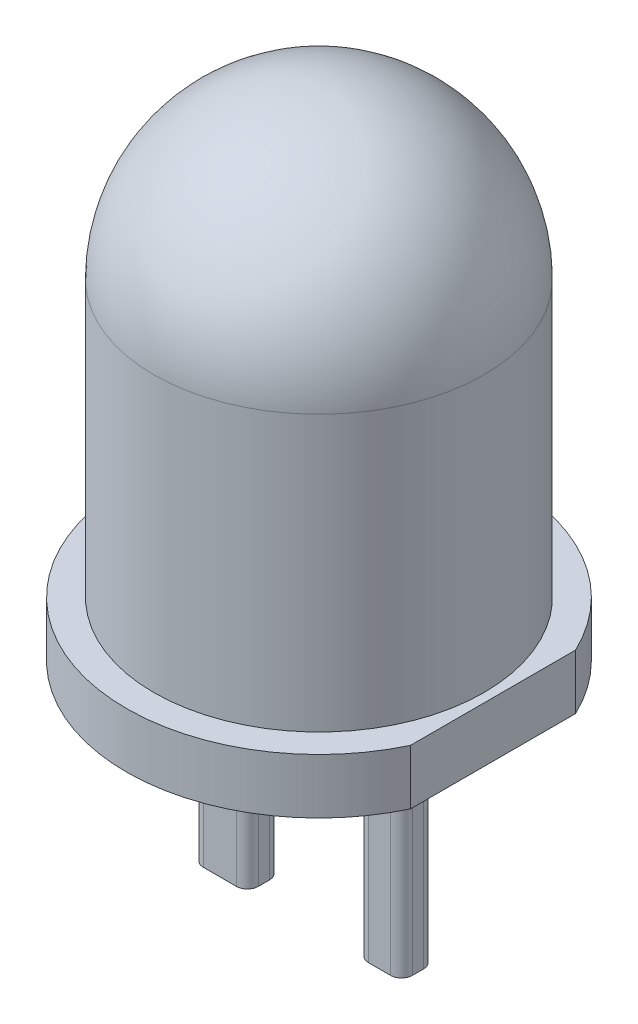
ISO-10303-21;
HEADER;
FILE_DESCRIPTION(('STEP AP214'),'2;1');
FILE_NAME('part.step','',(''),(''),'','','');
FILE_SCHEMA(('AUTOMOTIVE_DESIGN { 1 0 10303 214 1 1 1 1 }'));
ENDSEC;
DATA;
#1=APPLICATION_CONTEXT('core data for automotive mechanical design processes');
#2=APPLICATION_PROTOCOL_DEFINITION('international standard','automotive_design',2000,#1);
#3=PRODUCT_CONTEXT('',#1,'mechanical');
#4=PRODUCT('Part','Part','',(#3));
#5=PRODUCT_RELATED_PRODUCT_CATEGORY('part','',(#4));
#6=PRODUCT_DEFINITION_FORMATION('','',#4);
#7=PRODUCT_DEFINITION_CONTEXT('part definition',#1,'design');
#8=PRODUCT_DEFINITION('design','',#6,#7);
#9=PRODUCT_DEFINITION_SHAPE('','',#8);
#10=(LENGTH_UNIT() NAMED_UNIT(*) SI_UNIT(.MILLI.,.METRE.));
#11=(NAMED_UNIT(*) PLANE_ANGLE_UNIT() SI_UNIT($,.RADIAN.));
#12=(NAMED_UNIT(*) SI_UNIT($,.STERADIAN.) SOLID_ANGLE_UNIT());
#13=UNCERTAINTY_MEASURE_WITH_UNIT(LENGTH_MEASURE(1.E-05),#10,'distance_accuracy_value','');
#14=(GEOMETRIC_REPRESENTATION_CONTEXT(3) GLOBAL_UNCERTAINTY_ASSIGNED_CONTEXT((#13)) GLOBAL_UNIT_ASSIGNED_CONTEXT((#10,
#11,#12)) REPRESENTATION_CONTEXT('',''));
#15=CARTESIAN_POINT('',(0.,0.,0.));
#16=DIRECTION('',(0.,0.,1.));
#17=DIRECTION('',(1.,0.,0.));
#18=AXIS2_PLACEMENT_3D('',#15,#16,#17);
#19=CARTESIAN_POINT('',(0.,0.,0.));
#20=DIRECTION('',(0.,1.,0.));
#21=DIRECTION('',(0.,0.,1.));
#22=AXIS2_PLACEMENT_3D('',#19,#20,#21);
#23=PLANE('',#22);
#24=CARTESIAN_POINT('',(0.8,0.,0.05));
#25=DIRECTION('',(0.,-1.,0.));
#26=DIRECTION('',(0.,0.,1.));
#27=AXIS2_PLACEMENT_3D('',#24,#25,#26);
#28=CIRCLE('',#27,0.1);
#29=CARTESIAN_POINT('',(0.9,0.,0.0499999999999993));
#30=VERTEX_POINT('',#29);
#31=CARTESIAN_POINT('',(0.799999999999999,0.,0.15));
#32=VERTEX_POINT('',#31);
#33=EDGE_CURVE('E180',#30,#32,#28,.T.);
#34=ORIENTED_EDGE('',*,*,#33,.F.);
#35=DIRECTION('',(0.,0.,1.));
#36=VECTOR('',#35,1.);
#37=CARTESIAN_POINT('',(0.9,0.,0.0499999999999993));
#38=LINE('',#37,#36);
#39=CARTESIAN_POINT('',(0.9,0.,-0.0499999999999993));
#40=VERTEX_POINT('',#39);
#41=EDGE_CURVE('E193',#40,#30,#38,.T.);
#42=ORIENTED_EDGE('',*,*,#41,.F.);
#43=CARTESIAN_POINT('',(0.8,0.,-0.05));
#44=DIRECTION('',(0.,-1.,0.));
#45=DIRECTION('',(0.,0.,-1.));
#46=AXIS2_PLACEMENT_3D('',#43,#44,#45);
#47=CIRCLE('',#46,0.1);
#48=CARTESIAN_POINT('',(0.799999999999999,0.,-0.15));
#49=VERTEX_POINT('',#48);
#50=EDGE_CURVE('E222',#49,#40,#47,.T.);
#51=ORIENTED_EDGE('',*,*,#50,.F.);
#52=DIRECTION('',(1.,0.,0.));
#53=VECTOR('',#52,1.);
#54=CARTESIAN_POINT('',(0.600000000000001,0.,-0.15));
#55=LINE('',#54,#53);
#56=CARTESIAN_POINT('',(0.600000000000001,0.,-0.15));
#57=VERTEX_POINT('',#56);
#58=EDGE_CURVE('E219',#57,#49,#55,.T.);
#59=ORIENTED_EDGE('',*,*,#58,.F.);
#60=CARTESIAN_POINT('',(0.6,0.,-0.05));
#61=DIRECTION('',(0.,-1.,0.));
#62=DIRECTION('',(0.,0.,-1.));
#63=AXIS2_PLACEMENT_3D('',#60,#61,#62);
#64=CIRCLE('',#63,0.1);
#65=CARTESIAN_POINT('',(0.5,0.,-0.0499999999999993));
#66=VERTEX_POINT('',#65);
#67=EDGE_CURVE('E216',#66,#57,#64,.T.);
#68=ORIENTED_EDGE('',*,*,#67,.F.);
#69=DIRECTION('',(0.,0.,-1.));
#70=VECTOR('',#69,1.);
#71=CARTESIAN_POINT('',(0.5,0.,0.0499999999999993));
#72=LINE('',#71,#70);
#73=CARTESIAN_POINT('',(0.5,0.,0.0499999999999993));
#74=VERTEX_POINT('',#73);
#75=EDGE_CURVE('E213',#74,#66,#72,.T.);
#76=ORIENTED_EDGE('',*,*,#75,.F.);
#77=CARTESIAN_POINT('',(0.6,0.,0.05));
#78=DIRECTION('',(0.,-1.,0.));
#79=DIRECTION('',(0.,0.,-1.));
#80=AXIS2_PLACEMENT_3D('',#77,#78,#79);
#81=CIRCLE('',#80,0.1);
#82=CARTESIAN_POINT('',(0.6,0.,0.15));
#83=VERTEX_POINT('',#82);
#84=EDGE_CURVE('E210',#83,#74,#81,.T.);
#85=ORIENTED_EDGE('',*,*,#84,.F.);
#86=DIRECTION('',(-1.,0.,0.));
#87=VECTOR('',#86,1.);
#88=CARTESIAN_POINT('',(0.600000000000001,0.,0.15));
#89=LINE('',#88,#87);
#90=EDGE_CURVE('E183',#32,#83,#89,.T.);
#91=ORIENTED_EDGE('',*,*,#90,.F.);
#92=EDGE_LOOP('',(#34,#42,#51,#59,#68,#76,#85,#91));
#93=FACE_BOUND('',#92,.T.);
#94=CARTESIAN_POINT('',(0.,0.,0.));
#95=DIRECTION('',(0.,-1.,0.));
#96=DIRECTION('',(0.,0.,-1.));
#97=AXIS2_PLACEMENT_3D('',#94,#95,#96);
#98=CIRCLE('',#97,1.75);
#99=CARTESIAN_POINT('',(1.58113883008419,0.,0.75));
#100=VERTEX_POINT('',#99);
#101=CARTESIAN_POINT('',(1.58113883008419,0.,-0.75));
#102=VERTEX_POINT('',#101);
#103=EDGE_CURVE('E42',#100,#102,#98,.T.);
#104=ORIENTED_EDGE('',*,*,#103,.T.);
#105=DIRECTION('',(0.,0.,-1.));
#106=VECTOR('',#105,1.);
#107=CARTESIAN_POINT('',(1.58113883008419,0.,-0.75));
#108=LINE('',#107,#106);
#109=EDGE_CURVE('E250',#100,#102,#108,.T.);
#110=ORIENTED_EDGE('',*,*,#109,.F.);
#111=EDGE_LOOP('',(#104,#110));
#112=FACE_BOUND('',#111,.T.);
#113=CARTESIAN_POINT('',(-0.6,0.,-0.05));
#114=DIRECTION('',(0.,-1.,0.));
#115=DIRECTION('',(0.,0.,-1.));
#116=AXIS2_PLACEMENT_3D('',#113,#114,#115);
#117=CIRCLE('',#116,0.1);
#118=CARTESIAN_POINT('',(-0.600000000000001,0.,-0.15));
#119=VERTEX_POINT('',#118);
#120=CARTESIAN_POINT('',(-0.5,0.,-0.0499999999999993));
#121=VERTEX_POINT('',#120);
#122=EDGE_CURVE('E179',#119,#121,#117,.T.);
#123=ORIENTED_EDGE('',*,*,#122,.F.);
#124=DIRECTION('',(1.,0.,0.));
#125=VECTOR('',#124,1.);
#126=CARTESIAN_POINT('',(-0.899999999999999,0.,-0.15));
#127=LINE('',#126,#125);
#128=CARTESIAN_POINT('',(-0.899999999999999,0.,-0.15));
#129=VERTEX_POINT('',#128);
#130=EDGE_CURVE('E176',#129,#119,#127,.T.);
#131=ORIENTED_EDGE('',*,*,#130,.F.);
#132=CARTESIAN_POINT('',(-0.9,0.,-0.05));
#133=DIRECTION('',(0.,-1.,0.));
#134=DIRECTION('',(0.,0.,-1.));
#135=AXIS2_PLACEMENT_3D('',#132,#133,#134);
#136=CIRCLE('',#135,0.1);
#137=CARTESIAN_POINT('',(-1.,0.,-0.0499999999999993));
#138=VERTEX_POINT('',#137);
#139=EDGE_CURVE('E527',#138,#129,#136,.T.);
#140=ORIENTED_EDGE('',*,*,#139,.F.);
#141=DIRECTION('',(0.,0.,-1.));
#142=VECTOR('',#141,1.);
#143=CARTESIAN_POINT('',(-1.,0.,0.0499999999999993));
#144=LINE('',#143,#142);
#145=CARTESIAN_POINT('',(-1.,0.,0.0499999999999993));
#146=VERTEX_POINT('',#145);
#147=EDGE_CURVE('E558',#146,#138,#144,.T.);
#148=ORIENTED_EDGE('',*,*,#147,.F.);
#149=CARTESIAN_POINT('',(-0.9,0.,0.05));
#150=DIRECTION('',(0.,-1.,0.));
#151=DIRECTION('',(0.,0.,-1.));
#152=AXIS2_PLACEMENT_3D('',#149,#150,#151);
#153=CIRCLE('',#152,0.1);
#154=CARTESIAN_POINT('',(-0.9,0.,0.15));
#155=VERTEX_POINT('',#154);
#156=EDGE_CURVE('E551',#155,#146,#153,.T.);
#157=ORIENTED_EDGE('',*,*,#156,.F.);
#158=DIRECTION('',(-1.,0.,0.));
#159=VECTOR('',#158,1.);
#160=CARTESIAN_POINT('',(-0.899999999999999,0.,0.15));
#161=LINE('',#160,#159);
#162=CARTESIAN_POINT('',(-0.600000000000001,0.,0.15));
#163=VERTEX_POINT('',#162);
#164=EDGE_CURVE('E548',#163,#155,#161,.T.);
#165=ORIENTED_EDGE('',*,*,#164,.F.);
#166=CARTESIAN_POINT('',(-0.6,0.,0.05));
#167=DIRECTION('',(0.,-1.,0.));
#168=DIRECTION('',(0.,0.,1.));
#169=AXIS2_PLACEMENT_3D('',#166,#167,#168);
#170=CIRCLE('',#169,0.1);
#171=CARTESIAN_POINT('',(-0.5,0.,0.0499999999999993));
#172=VERTEX_POINT('',#171);
#173=EDGE_CURVE('E54',#172,#163,#170,.T.);
#174=ORIENTED_EDGE('',*,*,#173,.F.);
#175=DIRECTION('',(0.,0.,1.));
#176=VECTOR('',#175,1.);
#177=CARTESIAN_POINT('',(-0.5,0.,0.0499999999999993));
#178=LINE('',#177,#176);
#179=EDGE_CURVE('E49',#121,#172,#178,.T.);
#180=ORIENTED_EDGE('',*,*,#179,.F.);
#181=EDGE_LOOP('',(#123,#131,#140,#148,#157,#165,#174,#180));
#182=FACE_BOUND('',#181,.T.);
#183=ADVANCED_FACE('F35',(#93,#112,#182),#23,.F.);
#184=CARTESIAN_POINT('',(0.,0.,0.));
#185=DIRECTION('',(0.,-1.,0.));
#186=DIRECTION('',(0.,0.,-1.));
#187=AXIS2_PLACEMENT_3D('',#184,#185,#186);
#188=CYLINDRICAL_SURFACE('',#187,1.75);
#189=CARTESIAN_POINT('',(0.,0.5,0.));
#190=DIRECTION('',(0.,-1.,0.));
#191=DIRECTION('',(0.,0.,-1.));
#192=AXIS2_PLACEMENT_3D('',#189,#190,#191);
#193=CIRCLE('',#192,1.75);
#194=CARTESIAN_POINT('',(1.58113883008419,0.5,0.75));
#195=VERTEX_POINT('',#194);
#196=CARTESIAN_POINT('',(1.58113883008419,0.5,-0.75));
#197=VERTEX_POINT('',#196);
#198=EDGE_CURVE('E263',#195,#197,#193,.T.);
#199=ORIENTED_EDGE('',*,*,#198,.T.);
#200=DIRECTION('',(0.,-1.,0.));
#201=VECTOR('',#200,1.);
#202=CARTESIAN_POINT('',(1.58113883008419,1.,-0.75));
#203=LINE('',#202,#201);
#204=EDGE_CURVE('E253',#197,#102,#203,.T.);
#205=ORIENTED_EDGE('',*,*,#204,.T.);
#206=ORIENTED_EDGE('',*,*,#103,.F.);
#207=DIRECTION('',(0.,-1.,0.));
#208=VECTOR('',#207,1.);
#209=CARTESIAN_POINT('',(1.58113883008419,1.,0.75));
#210=LINE('',#209,#208);
#211=EDGE_CURVE('E252',#195,#100,#210,.T.);
#212=ORIENTED_EDGE('',*,*,#211,.F.);
#213=EDGE_LOOP('',(#199,#205,#206,#212));
#214=FACE_BOUND('',#213,.T.);
#215=ADVANCED_FACE('F271',(#214),#188,.T.);
#216=CARTESIAN_POINT('',(-1.75,0.5,0.));
#217=DIRECTION('',(0.,-1.,0.));
#218=DIRECTION('',(0.,0.,-1.));
#219=AXIS2_PLACEMENT_3D('',#216,#217,#218);
#220=PLANE('',#219);
#221=ORIENTED_EDGE('',*,*,#198,.F.);
#222=DIRECTION('',(0.,0.,-1.));
#223=VECTOR('',#222,1.);
#224=CARTESIAN_POINT('',(1.58113883008419,0.5,0.));
#225=LINE('',#224,#223);
#226=EDGE_CURVE('E11',#195,#197,#225,.T.);
#227=ORIENTED_EDGE('',*,*,#226,.T.);
#228=EDGE_LOOP('',(#221,#227));
#229=FACE_BOUND('',#228,.T.);
#230=CARTESIAN_POINT('',(0.,0.5,0.));
#231=DIRECTION('',(0.,-1.,0.));
#232=DIRECTION('',(0.,0.,-1.));
#233=AXIS2_PLACEMENT_3D('',#230,#231,#232);
#234=CIRCLE('',#233,1.5);
#235=CARTESIAN_POINT('',(0.,0.5,-1.5));
#236=VERTEX_POINT('',#235);
#237=EDGE_CURVE('E260',#236,#236,#234,.T.);
#238=ORIENTED_EDGE('',*,*,#237,.T.);
#239=EDGE_LOOP('',(#238));
#240=FACE_BOUND('',#239,.T.);
#241=ADVANCED_FACE('F276',(#229,#240),#220,.F.);
#242=CARTESIAN_POINT('',(0.,0.,0.));
#243=DIRECTION('',(0.,-1.,0.));
#244=DIRECTION('',(0.,0.,-1.));
#245=AXIS2_PLACEMENT_3D('',#242,#243,#244);
#246=CYLINDRICAL_SURFACE('',#245,1.5);
#247=ORIENTED_EDGE('',*,*,#237,.F.);
#248=EDGE_LOOP('',(#247));
#249=FACE_BOUND('',#248,.T.);
#250=CARTESIAN_POINT('',(0.,3.00000000000001,0.));
#251=DIRECTION('',(0.,-1.,0.));
#252=DIRECTION('',(0.,0.,-1.));
#253=AXIS2_PLACEMENT_3D('',#250,#251,#252);
#254=CIRCLE('',#253,1.5);
#255=CARTESIAN_POINT('',(0.,3.00000000000001,-1.5));
#256=VERTEX_POINT('',#255);
#257=EDGE_CURVE('E256',#256,#256,#254,.T.);
#258=ORIENTED_EDGE('',*,*,#257,.T.);
#259=EDGE_LOOP('',(#258));
#260=FACE_BOUND('',#259,.T.);
#261=ADVANCED_FACE('F279',(#249,#260),#246,.T.);
#262=CARTESIAN_POINT('',(0.,3.00000000000001,0.));
#263=DIRECTION('',(0.,-1.,0.));
#264=DIRECTION('',(1.,0.,0.));
#265=AXIS2_PLACEMENT_3D('',#262,#263,#264);
#266=SPHERICAL_SURFACE('',#265,1.49999999999999);
#267=ORIENTED_EDGE('',*,*,#257,.F.);
#268=EDGE_LOOP('',(#267));
#269=FACE_BOUND('',#268,.T.);
#270=ADVANCED_FACE('F285',(#269),#266,.T.);
#271=CARTESIAN_POINT('',(1.58113883008419,1.,-0.75));
#272=DIRECTION('',(-1.,0.,0.));
#273=DIRECTION('',(0.,0.,1.));
#274=AXIS2_PLACEMENT_3D('',#271,#272,#273);
#275=PLANE('',#274);
#276=ORIENTED_EDGE('',*,*,#211,.T.);
#277=ORIENTED_EDGE('',*,*,#109,.T.);
#278=ORIENTED_EDGE('',*,*,#204,.F.);
#279=ORIENTED_EDGE('',*,*,#226,.F.);
#280=EDGE_LOOP('',(#276,#277,#278,#279));
#281=FACE_BOUND('',#280,.T.);
#282=ADVANCED_FACE('F274',(#281),#275,.F.);
#283=CARTESIAN_POINT('',(0.8,-2.,0.05));
#284=DIRECTION('',(0.,1.,0.));
#285=DIRECTION('',(0.,0.,1.));
#286=AXIS2_PLACEMENT_3D('',#283,#284,#285);
#287=CYLINDRICAL_SURFACE('',#286,0.1);
#288=ORIENTED_EDGE('',*,*,#33,.T.);
#289=DIRECTION('',(0.,1.,0.));
#290=VECTOR('',#289,1.);
#291=CARTESIAN_POINT('',(0.799999999999999,-2.,0.15));
#292=LINE('',#291,#290);
#293=CARTESIAN_POINT('',(0.799999999999999,-2.,0.15));
#294=VERTEX_POINT('',#293);
#295=EDGE_CURVE('E247',#294,#32,#292,.T.);
#296=ORIENTED_EDGE('',*,*,#295,.F.);
#297=CARTESIAN_POINT('',(0.8,-2.,0.05));
#298=DIRECTION('',(0.,-1.,0.));
#299=DIRECTION('',(0.,0.,1.));
#300=AXIS2_PLACEMENT_3D('',#297,#298,#299);
#301=CIRCLE('',#300,0.1);
#302=CARTESIAN_POINT('',(0.9,-2.,0.0499999999999993));
#303=VERTEX_POINT('',#302);
#304=EDGE_CURVE('E189',#303,#294,#301,.T.);
#305=ORIENTED_EDGE('',*,*,#304,.F.);
#306=DIRECTION('',(0.,1.,0.));
#307=VECTOR('',#306,1.);
#308=CARTESIAN_POINT('',(0.9,-2.,0.0499999999999993));
#309=LINE('',#308,#307);
#310=EDGE_CURVE('E206',#303,#30,#309,.T.);
#311=ORIENTED_EDGE('',*,*,#310,.T.);
#312=EDGE_LOOP('',(#288,#296,#305,#311));
#313=FACE_BOUND('',#312,.T.);
#314=ADVANCED_FACE('F294',(#313),#287,.T.);
#315=CARTESIAN_POINT('',(0.600000000000001,-2.,0.15));
#316=DIRECTION('',(0.,0.,-1.));
#317=DIRECTION('',(-1.,0.,0.));
#318=AXIS2_PLACEMENT_3D('',#315,#316,#317);
#319=PLANE('',#318);
#320=ORIENTED_EDGE('',*,*,#90,.T.);
#321=DIRECTION('',(0.,1.,0.));
#322=VECTOR('',#321,1.);
#323=CARTESIAN_POINT('',(0.600000000000001,-2.,0.15));
#324=LINE('',#323,#322);
#325=CARTESIAN_POINT('',(0.600000000000001,-2.,0.15));
#326=VERTEX_POINT('',#325);
#327=EDGE_CURVE('E244',#326,#83,#324,.T.);
#328=ORIENTED_EDGE('',*,*,#327,.F.);
#329=DIRECTION('',(-1.,0.,0.));
#330=VECTOR('',#329,1.);
#331=CARTESIAN_POINT('',(0.600000000000001,-2.,0.15));
#332=LINE('',#331,#330);
#333=EDGE_CURVE('E192',#294,#326,#332,.T.);
#334=ORIENTED_EDGE('',*,*,#333,.F.);
#335=ORIENTED_EDGE('',*,*,#295,.T.);
#336=EDGE_LOOP('',(#320,#328,#334,#335));
#337=FACE_BOUND('',#336,.T.);
#338=ADVANCED_FACE('F332',(#337),#319,.F.);
#339=CARTESIAN_POINT('',(0.6,-2.,0.05));
#340=DIRECTION('',(0.,1.,0.));
#341=DIRECTION('',(0.,0.,1.));
#342=AXIS2_PLACEMENT_3D('',#339,#340,#341);
#343=CYLINDRICAL_SURFACE('',#342,0.1);
#344=ORIENTED_EDGE('',*,*,#84,.T.);
#345=DIRECTION('',(0.,1.,0.));
#346=VECTOR('',#345,1.);
#347=CARTESIAN_POINT('',(0.5,-2.,0.0499999999999993));
#348=LINE('',#347,#346);
#349=CARTESIAN_POINT('',(0.5,-2.,0.0499999999999993));
#350=VERTEX_POINT('',#349);
#351=EDGE_CURVE('E241',#350,#74,#348,.T.);
#352=ORIENTED_EDGE('',*,*,#351,.F.);
#353=CARTESIAN_POINT('',(0.6,-2.,0.05));
#354=DIRECTION('',(0.,-1.,0.));
#355=DIRECTION('',(0.,0.,-1.));
#356=AXIS2_PLACEMENT_3D('',#353,#354,#355);
#357=CIRCLE('',#356,0.1);
#358=EDGE_CURVE('E195',#326,#350,#357,.T.);
#359=ORIENTED_EDGE('',*,*,#358,.F.);
#360=ORIENTED_EDGE('',*,*,#327,.T.);
#361=EDGE_LOOP('',(#344,#352,#359,#360));
#362=FACE_BOUND('',#361,.T.);
#363=ADVANCED_FACE('F330',(#362),#343,.T.);
#364=CARTESIAN_POINT('',(0.5,-2.,0.0499999999999993));
#365=DIRECTION('',(1.,0.,0.));
#366=DIRECTION('',(0.,0.,-1.));
#367=AXIS2_PLACEMENT_3D('',#364,#365,#366);
#368=PLANE('',#367);
#369=ORIENTED_EDGE('',*,*,#75,.T.);
#370=DIRECTION('',(0.,1.,0.));
#371=VECTOR('',#370,1.);
#372=CARTESIAN_POINT('',(0.5,-2.,-0.0499999999999993));
#373=LINE('',#372,#371);
#374=CARTESIAN_POINT('',(0.5,-2.,-0.0499999999999993));
#375=VERTEX_POINT('',#374);
#376=EDGE_CURVE('E238',#375,#66,#373,.T.);
#377=ORIENTED_EDGE('',*,*,#376,.F.);
#378=DIRECTION('',(0.,0.,-1.));
#379=VECTOR('',#378,1.);
#380=CARTESIAN_POINT('',(0.5,-2.,0.0499999999999993));
#381=LINE('',#380,#379);
#382=EDGE_CURVE('E197',#350,#375,#381,.T.);
#383=ORIENTED_EDGE('',*,*,#382,.F.);
#384=ORIENTED_EDGE('',*,*,#351,.T.);
#385=EDGE_LOOP('',(#369,#377,#383,#384));
#386=FACE_BOUND('',#385,.T.);
#387=ADVANCED_FACE('F325',(#386),#368,.F.);
#388=CARTESIAN_POINT('',(0.6,-2.,-0.05));
#389=DIRECTION('',(0.,1.,0.));
#390=DIRECTION('',(0.,0.,1.));
#391=AXIS2_PLACEMENT_3D('',#388,#389,#390);
#392=CYLINDRICAL_SURFACE('',#391,0.1);
#393=ORIENTED_EDGE('',*,*,#67,.T.);
#394=DIRECTION('',(0.,1.,0.));
#395=VECTOR('',#394,1.);
#396=CARTESIAN_POINT('',(0.600000000000001,-2.,-0.15));
#397=LINE('',#396,#395);
#398=CARTESIAN_POINT('',(0.600000000000001,-2.,-0.15));
#399=VERTEX_POINT('',#398);
#400=EDGE_CURVE('E235',#399,#57,#397,.T.);
#401=ORIENTED_EDGE('',*,*,#400,.F.);
#402=CARTESIAN_POINT('',(0.6,-2.,-0.05));
#403=DIRECTION('',(0.,-1.,0.));
#404=DIRECTION('',(0.,0.,-1.));
#405=AXIS2_PLACEMENT_3D('',#402,#403,#404);
#406=CIRCLE('',#405,0.1);
#407=EDGE_CURVE('E199',#375,#399,#406,.T.);
#408=ORIENTED_EDGE('',*,*,#407,.F.);
#409=ORIENTED_EDGE('',*,*,#376,.T.);
#410=EDGE_LOOP('',(#393,#401,#408,#409));
#411=FACE_BOUND('',#410,.T.);
#412=ADVANCED_FACE('F322',(#411),#392,.T.);
#413=CARTESIAN_POINT('',(0.600000000000001,-2.,-0.15));
#414=DIRECTION('',(0.,0.,1.));
#415=DIRECTION('',(1.,0.,0.));
#416=AXIS2_PLACEMENT_3D('',#413,#414,#415);
#417=PLANE('',#416);
#418=ORIENTED_EDGE('',*,*,#58,.T.);
#419=DIRECTION('',(0.,1.,0.));
#420=VECTOR('',#419,1.);
#421=CARTESIAN_POINT('',(0.799999999999999,-2.,-0.15));
#422=LINE('',#421,#420);
#423=CARTESIAN_POINT('',(0.799999999999999,-2.,-0.15));
#424=VERTEX_POINT('',#423);
#425=EDGE_CURVE('E232',#424,#49,#422,.T.);
#426=ORIENTED_EDGE('',*,*,#425,.F.);
#427=DIRECTION('',(1.,0.,0.));
#428=VECTOR('',#427,1.);
#429=CARTESIAN_POINT('',(0.600000000000001,-2.,-0.15));
#430=LINE('',#429,#428);
#431=EDGE_CURVE('E201',#399,#424,#430,.T.);
#432=ORIENTED_EDGE('',*,*,#431,.F.);
#433=ORIENTED_EDGE('',*,*,#400,.T.);
#434=EDGE_LOOP('',(#418,#426,#432,#433));
#435=FACE_BOUND('',#434,.T.);
#436=ADVANCED_FACE('F318',(#435),#417,.F.);
#437=CARTESIAN_POINT('',(0.8,-2.,-0.05));
#438=DIRECTION('',(0.,1.,0.));
#439=DIRECTION('',(0.,0.,1.));
#440=AXIS2_PLACEMENT_3D('',#437,#438,#439);
#441=CYLINDRICAL_SURFACE('',#440,0.1);
#442=ORIENTED_EDGE('',*,*,#50,.T.);
#443=DIRECTION('',(0.,1.,0.));
#444=VECTOR('',#443,1.);
#445=CARTESIAN_POINT('',(0.9,-2.,-0.0499999999999993));
#446=LINE('',#445,#444);
#447=CARTESIAN_POINT('',(0.9,-2.,-0.0499999999999993));
#448=VERTEX_POINT('',#447);
#449=EDGE_CURVE('E229',#448,#40,#446,.T.);
#450=ORIENTED_EDGE('',*,*,#449,.F.);
#451=CARTESIAN_POINT('',(0.8,-2.,-0.05));
#452=DIRECTION('',(0.,-1.,0.));
#453=DIRECTION('',(0.,0.,-1.));
#454=AXIS2_PLACEMENT_3D('',#451,#452,#453);
#455=CIRCLE('',#454,0.1);
#456=EDGE_CURVE('E203',#424,#448,#455,.T.);
#457=ORIENTED_EDGE('',*,*,#456,.F.);
#458=ORIENTED_EDGE('',*,*,#425,.T.);
#459=EDGE_LOOP('',(#442,#450,#457,#458));
#460=FACE_BOUND('',#459,.T.);
#461=ADVANCED_FACE('F316',(#460),#441,.T.);
#462=CARTESIAN_POINT('',(0.9,-2.,0.0499999999999993));
#463=DIRECTION('',(-1.,0.,0.));
#464=DIRECTION('',(0.,0.,1.));
#465=AXIS2_PLACEMENT_3D('',#462,#463,#464);
#466=PLANE('',#465);
#467=ORIENTED_EDGE('',*,*,#41,.T.);
#468=ORIENTED_EDGE('',*,*,#310,.F.);
#469=DIRECTION('',(0.,0.,1.));
#470=VECTOR('',#469,1.);
#471=CARTESIAN_POINT('',(0.9,-2.,0.0499999999999993));
#472=LINE('',#471,#470);
#473=EDGE_CURVE('E205',#448,#303,#472,.T.);
#474=ORIENTED_EDGE('',*,*,#473,.F.);
#475=ORIENTED_EDGE('',*,*,#449,.T.);
#476=EDGE_LOOP('',(#467,#468,#474,#475));
#477=FACE_BOUND('',#476,.T.);
#478=ADVANCED_FACE('F305',(#477),#466,.F.);
#479=CARTESIAN_POINT('',(0.8,-2.,0.05));
#480=DIRECTION('',(0.,1.,0.));
#481=DIRECTION('',(0.,0.,1.));
#482=AXIS2_PLACEMENT_3D('',#479,#480,#481);
#483=PLANE('',#482);
#484=ORIENTED_EDGE('',*,*,#304,.T.);
#485=ORIENTED_EDGE('',*,*,#333,.T.);
#486=ORIENTED_EDGE('',*,*,#358,.T.);
#487=ORIENTED_EDGE('',*,*,#382,.T.);
#488=ORIENTED_EDGE('',*,*,#407,.T.);
#489=ORIENTED_EDGE('',*,*,#431,.T.);
#490=ORIENTED_EDGE('',*,*,#456,.T.);
#491=ORIENTED_EDGE('',*,*,#473,.T.);
#492=EDGE_LOOP('',(#484,#485,#486,#487,#488,#489,#490,#491));
#493=FACE_BOUND('',#492,.T.);
#494=ADVANCED_FACE('F310',(#493),#483,.F.);
#495=CARTESIAN_POINT('',(-0.6,-2.,-0.05));
#496=DIRECTION('',(0.,1.,0.));
#497=DIRECTION('',(0.,0.,1.));
#498=AXIS2_PLACEMENT_3D('',#495,#496,#497);
#499=CYLINDRICAL_SURFACE('',#498,0.1);
#500=ORIENTED_EDGE('',*,*,#122,.T.);
#501=DIRECTION('',(0.,1.,0.));
#502=VECTOR('',#501,1.);
#503=CARTESIAN_POINT('',(-0.5,-2.,-0.0499999999999993));
#504=LINE('',#503,#502);
#505=CARTESIAN_POINT('',(-0.5,-2.,-0.0499999999999993));
#506=VERTEX_POINT('',#505);
#507=EDGE_CURVE('E160',#506,#121,#504,.T.);
#508=ORIENTED_EDGE('',*,*,#507,.F.);
#509=CARTESIAN_POINT('',(-0.6,-2.,-0.05));
#510=DIRECTION('',(0.,-1.,0.));
#511=DIRECTION('',(0.,0.,-1.));
#512=AXIS2_PLACEMENT_3D('',#509,#510,#511);
#513=CIRCLE('',#512,0.1);
#514=CARTESIAN_POINT('',(-0.600000000000001,-2.,-0.15));
#515=VERTEX_POINT('',#514);
#516=EDGE_CURVE('E167',#515,#506,#513,.T.);
#517=ORIENTED_EDGE('',*,*,#516,.F.);
#518=DIRECTION('',(0.,1.,0.));
#519=VECTOR('',#518,1.);
#520=CARTESIAN_POINT('',(-0.600000000000001,-2.,-0.15));
#521=LINE('',#520,#519);
#522=EDGE_CURVE('E523',#515,#119,#521,.T.);
#523=ORIENTED_EDGE('',*,*,#522,.T.);
#524=EDGE_LOOP('',(#500,#508,#517,#523));
#525=FACE_BOUND('',#524,.T.);
#526=ADVANCED_FACE('F178',(#525),#499,.T.);
#527=CARTESIAN_POINT('',(-0.5,-2.,0.0499999999999993));
#528=DIRECTION('',(-1.,0.,0.));
#529=DIRECTION('',(0.,0.,1.));
#530=AXIS2_PLACEMENT_3D('',#527,#528,#529);
#531=PLANE('',#530);
#532=ORIENTED_EDGE('',*,*,#179,.T.);
#533=DIRECTION('',(0.,1.,0.));
#534=VECTOR('',#533,1.);
#535=CARTESIAN_POINT('',(-0.5,-2.,0.0499999999999993));
#536=LINE('',#535,#534);
#537=CARTESIAN_POINT('',(-0.5,-2.,0.0499999999999993));
#538=VERTEX_POINT('',#537);
#539=EDGE_CURVE('E163',#538,#172,#536,.T.);
#540=ORIENTED_EDGE('',*,*,#539,.F.);
#541=DIRECTION('',(0.,0.,1.));
#542=VECTOR('',#541,1.);
#543=CARTESIAN_POINT('',(-0.5,-2.,0.0499999999999993));
#544=LINE('',#543,#542);
#545=EDGE_CURVE('E156',#506,#538,#544,.T.);
#546=ORIENTED_EDGE('',*,*,#545,.F.);
#547=ORIENTED_EDGE('',*,*,#507,.T.);
#548=EDGE_LOOP('',(#532,#540,#546,#547));
#549=FACE_BOUND('',#548,.T.);
#550=ADVANCED_FACE('F158',(#549),#531,.F.);
#551=CARTESIAN_POINT('',(-0.6,-2.,0.05));
#552=DIRECTION('',(0.,1.,0.));
#553=DIRECTION('',(0.,0.,1.));
#554=AXIS2_PLACEMENT_3D('',#551,#552,#553);
#555=CYLINDRICAL_SURFACE('',#554,0.1);
#556=ORIENTED_EDGE('',*,*,#173,.T.);
#557=DIRECTION('',(0.,1.,0.));
#558=VECTOR('',#557,1.);
#559=CARTESIAN_POINT('',(-0.600000000000001,-2.,0.15));
#560=LINE('',#559,#558);
#561=CARTESIAN_POINT('',(-0.600000000000001,-2.,0.15));
#562=VERTEX_POINT('',#561);
#563=EDGE_CURVE('E185',#562,#163,#560,.T.);
#564=ORIENTED_EDGE('',*,*,#563,.F.);
#565=CARTESIAN_POINT('',(-0.6,-2.,0.05));
#566=DIRECTION('',(0.,-1.,0.));
#567=DIRECTION('',(0.,0.,1.));
#568=AXIS2_PLACEMENT_3D('',#565,#566,#567);
#569=CIRCLE('',#568,0.1);
#570=EDGE_CURVE('E166',#538,#562,#569,.T.);
#571=ORIENTED_EDGE('',*,*,#570,.F.);
#572=ORIENTED_EDGE('',*,*,#539,.T.);
#573=EDGE_LOOP('',(#556,#564,#571,#572));
#574=FACE_BOUND('',#573,.T.);
#575=ADVANCED_FACE('F358',(#574),#555,.T.);
#576=CARTESIAN_POINT('',(-0.899999999999999,-2.,0.15));
#577=DIRECTION('',(0.,0.,-1.));
#578=DIRECTION('',(-1.,0.,0.));
#579=AXIS2_PLACEMENT_3D('',#576,#577,#578);
#580=PLANE('',#579);
#581=ORIENTED_EDGE('',*,*,#164,.T.);
#582=DIRECTION('',(0.,1.,0.));
#583=VECTOR('',#582,1.);
#584=CARTESIAN_POINT('',(-0.899999999999999,-2.,0.15));
#585=LINE('',#584,#583);
#586=CARTESIAN_POINT('',(-0.899999999999999,-2.,0.15));
#587=VERTEX_POINT('',#586);
#588=EDGE_CURVE('E541',#587,#155,#585,.T.);
#589=ORIENTED_EDGE('',*,*,#588,.F.);
#590=DIRECTION('',(-1.,0.,0.));
#591=VECTOR('',#590,1.);
#592=CARTESIAN_POINT('',(-0.899999999999999,-2.,0.15));
#593=LINE('',#592,#591);
#594=EDGE_CURVE('E549',#562,#587,#593,.T.);
#595=ORIENTED_EDGE('',*,*,#594,.F.);
#596=ORIENTED_EDGE('',*,*,#563,.T.);
#597=EDGE_LOOP('',(#581,#589,#595,#596));
#598=FACE_BOUND('',#597,.T.);
#599=ADVANCED_FACE('F361',(#598),#580,.F.);
#600=CARTESIAN_POINT('',(-0.9,-2.,0.05));
#601=DIRECTION('',(0.,1.,0.));
#602=DIRECTION('',(0.,0.,1.));
#603=AXIS2_PLACEMENT_3D('',#600,#601,#602);
#604=CYLINDRICAL_SURFACE('',#603,0.1);
#605=ORIENTED_EDGE('',*,*,#156,.T.);
#606=DIRECTION('',(0.,1.,0.));
#607=VECTOR('',#606,1.);
#608=CARTESIAN_POINT('',(-1.,-2.,0.0499999999999993));
#609=LINE('',#608,#607);
#610=CARTESIAN_POINT('',(-1.,-2.,0.0499999999999993));
#611=VERTEX_POINT('',#610);
#612=EDGE_CURVE('E538',#611,#146,#609,.T.);
#613=ORIENTED_EDGE('',*,*,#612,.F.);
#614=CARTESIAN_POINT('',(-0.9,-2.,0.05));
#615=DIRECTION('',(0.,-1.,0.));
#616=DIRECTION('',(0.,0.,-1.));
#617=AXIS2_PLACEMENT_3D('',#614,#615,#616);
#618=CIRCLE('',#617,0.1);
#619=EDGE_CURVE('E566',#587,#611,#618,.T.);
#620=ORIENTED_EDGE('',*,*,#619,.F.);
#621=ORIENTED_EDGE('',*,*,#588,.T.);
#622=EDGE_LOOP('',(#605,#613,#620,#621));
#623=FACE_BOUND('',#622,.T.);
#624=ADVANCED_FACE('F365',(#623),#604,.T.);
#625=CARTESIAN_POINT('',(-1.,-2.,0.0499999999999993));
#626=DIRECTION('',(1.,0.,0.));
#627=DIRECTION('',(0.,0.,-1.));
#628=AXIS2_PLACEMENT_3D('',#625,#626,#627);
#629=PLANE('',#628);
#630=ORIENTED_EDGE('',*,*,#147,.T.);
#631=DIRECTION('',(0.,1.,0.));
#632=VECTOR('',#631,1.);
#633=CARTESIAN_POINT('',(-1.,-2.,-0.0499999999999993));
#634=LINE('',#633,#632);
#635=CARTESIAN_POINT('',(-1.,-2.,-0.0499999999999993));
#636=VERTEX_POINT('',#635);
#637=EDGE_CURVE('E530',#636,#138,#634,.T.);
#638=ORIENTED_EDGE('',*,*,#637,.F.);
#639=DIRECTION('',(0.,0.,-1.));
#640=VECTOR('',#639,1.);
#641=CARTESIAN_POINT('',(-1.,-2.,0.0499999999999993));
#642=LINE('',#641,#640);
#643=EDGE_CURVE('E564',#611,#636,#642,.T.);
#644=ORIENTED_EDGE('',*,*,#643,.F.);
#645=ORIENTED_EDGE('',*,*,#612,.T.);
#646=EDGE_LOOP('',(#630,#638,#644,#645));
#647=FACE_BOUND('',#646,.T.);
#648=ADVANCED_FACE('F369',(#647),#629,.F.);
#649=CARTESIAN_POINT('',(-0.9,-2.,-0.05));
#650=DIRECTION('',(0.,1.,0.));
#651=DIRECTION('',(0.,0.,1.));
#652=AXIS2_PLACEMENT_3D('',#649,#650,#651);
#653=CYLINDRICAL_SURFACE('',#652,0.1);
#654=ORIENTED_EDGE('',*,*,#139,.T.);
#655=DIRECTION('',(0.,1.,0.));
#656=VECTOR('',#655,1.);
#657=CARTESIAN_POINT('',(-0.899999999999999,-2.,-0.15));
#658=LINE('',#657,#656);
#659=CARTESIAN_POINT('',(-0.899999999999999,-2.,-0.15));
#660=VERTEX_POINT('',#659);
#661=EDGE_CURVE('E525',#660,#129,#658,.T.);
#662=ORIENTED_EDGE('',*,*,#661,.F.);
#663=CARTESIAN_POINT('',(-0.9,-2.,-0.05));
#664=DIRECTION('',(0.,-1.,0.));
#665=DIRECTION('',(0.,0.,-1.));
#666=AXIS2_PLACEMENT_3D('',#663,#664,#665);
#667=CIRCLE('',#666,0.1);
#668=EDGE_CURVE('E532',#636,#660,#667,.T.);
#669=ORIENTED_EDGE('',*,*,#668,.F.);
#670=ORIENTED_EDGE('',*,*,#637,.T.);
#671=EDGE_LOOP('',(#654,#662,#669,#670));
#672=FACE_BOUND('',#671,.T.);
#673=ADVANCED_FACE('F373',(#672),#653,.T.);
#674=CARTESIAN_POINT('',(-0.899999999999999,-2.,-0.15));
#675=DIRECTION('',(0.,0.,1.));
#676=DIRECTION('',(1.,0.,0.));
#677=AXIS2_PLACEMENT_3D('',#674,#675,#676);
#678=PLANE('',#677);
#679=ORIENTED_EDGE('',*,*,#130,.T.);
#680=ORIENTED_EDGE('',*,*,#522,.F.);
#681=DIRECTION('',(1.,0.,0.));
#682=VECTOR('',#681,1.);
#683=CARTESIAN_POINT('',(-0.899999999999999,-2.,-0.15));
#684=LINE('',#683,#682);
#685=EDGE_CURVE('E172',#660,#515,#684,.T.);
#686=ORIENTED_EDGE('',*,*,#685,.F.);
#687=ORIENTED_EDGE('',*,*,#661,.T.);
#688=EDGE_LOOP('',(#679,#680,#686,#687));
#689=FACE_BOUND('',#688,.T.);
#690=ADVANCED_FACE('F377',(#689),#678,.F.);
#691=CARTESIAN_POINT('',(-0.6,-2.,-0.05));
#692=DIRECTION('',(0.,-1.,0.));
#693=DIRECTION('',(0.,0.,-1.));
#694=AXIS2_PLACEMENT_3D('',#691,#692,#693);
#695=PLANE('',#694);
#696=ORIENTED_EDGE('',*,*,#516,.T.);
#697=ORIENTED_EDGE('',*,*,#545,.T.);
#698=ORIENTED_EDGE('',*,*,#570,.T.);
#699=ORIENTED_EDGE('',*,*,#594,.T.);
#700=ORIENTED_EDGE('',*,*,#619,.T.);
#701=ORIENTED_EDGE('',*,*,#643,.T.);
#702=ORIENTED_EDGE('',*,*,#668,.T.);
#703=ORIENTED_EDGE('',*,*,#685,.T.);
#704=EDGE_LOOP('',(#696,#697,#698,#699,#700,#701,#702,#703));
#705=FACE_BOUND('',#704,.T.);
#706=ADVANCED_FACE('F170',(#705),#695,.T.);
#707=CLOSED_SHELL('',(#183,#215,#241,#261,#270,#282,#314,#338,#363,#387,#412,#436,#461,#478,
#494,#526,#550,#575,#599,#624,#648,#673,#690,#706));
#708=MANIFOLD_SOLID_BREP('B2',#707);
#709=ADVANCED_BREP_SHAPE_REPRESENTATION('',(#18,#708),#14);
#710=SHAPE_DEFINITION_REPRESENTATION(#9,#709);
ENDSEC;
END-ISO-10303-21;
